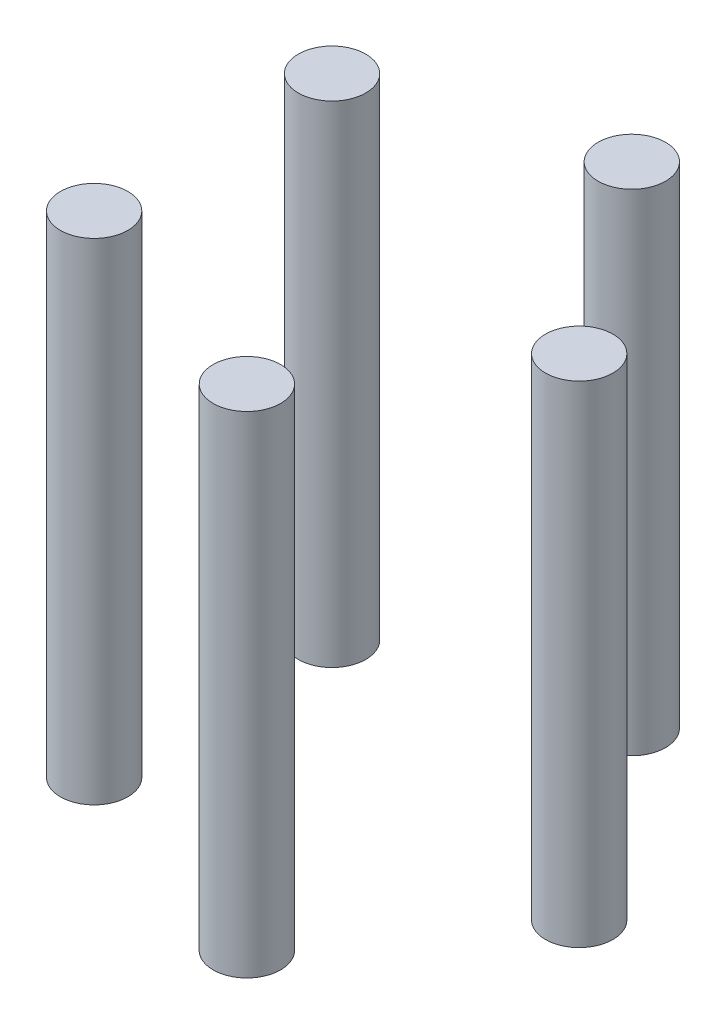
ISO-10303-21;
HEADER;
FILE_DESCRIPTION(('STEP AP214'),'2;1');
FILE_NAME('part.step','',(''),(''),'','','');
FILE_SCHEMA(('AUTOMOTIVE_DESIGN { 1 0 10303 214 1 1 1 1 }'));
ENDSEC;
DATA;
#1=APPLICATION_CONTEXT('core data for automotive mechanical design processes');
#2=APPLICATION_PROTOCOL_DEFINITION('international standard','automotive_design',2000,#1);
#3=PRODUCT_CONTEXT('',#1,'mechanical');
#4=PRODUCT('Part','Part','',(#3));
#5=PRODUCT_RELATED_PRODUCT_CATEGORY('part','',(#4));
#6=PRODUCT_DEFINITION_FORMATION('','',#4);
#7=PRODUCT_DEFINITION_CONTEXT('part definition',#1,'design');
#8=PRODUCT_DEFINITION('design','',#6,#7);
#9=PRODUCT_DEFINITION_SHAPE('','',#8);
#10=(LENGTH_UNIT() NAMED_UNIT(*) SI_UNIT(.MILLI.,.METRE.));
#11=(NAMED_UNIT(*) PLANE_ANGLE_UNIT() SI_UNIT($,.RADIAN.));
#12=(NAMED_UNIT(*) SI_UNIT($,.STERADIAN.) SOLID_ANGLE_UNIT());
#13=UNCERTAINTY_MEASURE_WITH_UNIT(LENGTH_MEASURE(1.E-05),#10,'distance_accuracy_value','');
#14=(GEOMETRIC_REPRESENTATION_CONTEXT(3) GLOBAL_UNCERTAINTY_ASSIGNED_CONTEXT((#13)) GLOBAL_UNIT_ASSIGNED_CONTEXT((#10,
#11,#12)) REPRESENTATION_CONTEXT('',''));
#15=CARTESIAN_POINT('',(0.,0.,0.));
#16=DIRECTION('',(0.,0.,1.));
#17=DIRECTION('',(1.,0.,0.));
#18=AXIS2_PLACEMENT_3D('',#15,#16,#17);
#19=CARTESIAN_POINT('',(10.1975608143727,80.,31.3848650377402));
#20=DIRECTION('',(0.,-1.,0.));
#21=DIRECTION('',(0.,0.,-1.));
#22=AXIS2_PLACEMENT_3D('',#19,#20,#21);
#23=CYLINDRICAL_SURFACE('',#22,5.5);
#24=CARTESIAN_POINT('',(10.1975608143727,80.,31.3848650377402));
#25=DIRECTION('',(0.,1.,0.));
#26=DIRECTION('',(0.,0.,1.));
#27=AXIS2_PLACEMENT_3D('',#24,#25,#26);
#28=CIRCLE('',#27,5.5);
#29=CARTESIAN_POINT('',(10.1975608143727,80.,36.8848650377402));
#30=VERTEX_POINT('',#29);
#31=EDGE_CURVE('E11',#30,#30,#28,.T.);
#32=ORIENTED_EDGE('',*,*,#31,.F.);
#33=EDGE_LOOP('',(#32));
#34=FACE_BOUND('',#33,.T.);
#35=CARTESIAN_POINT('',(10.1975608143727,0.,31.3848650377402));
#36=DIRECTION('',(0.,1.,0.));
#37=DIRECTION('',(0.,0.,1.));
#38=AXIS2_PLACEMENT_3D('',#35,#36,#37);
#39=CIRCLE('',#38,5.5);
#40=CARTESIAN_POINT('',(10.1975608143727,0.,36.8848650377402));
#41=VERTEX_POINT('',#40);
#42=EDGE_CURVE('E49',#41,#41,#39,.T.);
#43=ORIENTED_EDGE('',*,*,#42,.T.);
#44=EDGE_LOOP('',(#43));
#45=FACE_BOUND('',#44,.T.);
#46=ADVANCED_FACE('F46',(#34,#45),#23,.T.);
#47=CARTESIAN_POINT('',(0.,80.,0.));
#48=DIRECTION('',(0.,1.,0.));
#49=DIRECTION('',(0.,0.,1.));
#50=AXIS2_PLACEMENT_3D('',#47,#48,#49);
#51=PLANE('',#50);
#52=ORIENTED_EDGE('',*,*,#31,.T.);
#53=EDGE_LOOP('',(#52));
#54=FACE_BOUND('',#53,.T.);
#55=ADVANCED_FACE('F61',(#54),#51,.T.);
#56=CARTESIAN_POINT('',(0.,0.,0.));
#57=DIRECTION('',(0.,1.,0.));
#58=DIRECTION('',(0.,0.,1.));
#59=AXIS2_PLACEMENT_3D('',#56,#57,#58);
#60=PLANE('',#59);
#61=ORIENTED_EDGE('',*,*,#42,.F.);
#62=EDGE_LOOP('',(#61));
#63=FACE_BOUND('',#62,.T.);
#64=ADVANCED_FACE('F59',(#63),#60,.F.);
#65=CLOSED_SHELL('',(#46,#55,#64));
#66=MANIFOLD_SOLID_BREP('B2',#65);
#67=CARTESIAN_POINT('',(33.,80.,0.));
#68=DIRECTION('',(0.,-1.,0.));
#69=DIRECTION('',(0.,0.,-1.));
#70=AXIS2_PLACEMENT_3D('',#67,#68,#69);
#71=CYLINDRICAL_SURFACE('',#70,5.5);
#72=CARTESIAN_POINT('',(33.,80.,0.));
#73=DIRECTION('',(0.,1.,0.));
#74=DIRECTION('',(0.,0.,1.));
#75=AXIS2_PLACEMENT_3D('',#72,#73,#74);
#76=CIRCLE('',#75,5.5);
#77=CARTESIAN_POINT('',(33.,80.,5.5));
#78=VERTEX_POINT('',#77);
#79=EDGE_CURVE('E45',#78,#78,#76,.T.);
#80=ORIENTED_EDGE('',*,*,#79,.F.);
#81=EDGE_LOOP('',(#80));
#82=FACE_BOUND('',#81,.T.);
#83=CARTESIAN_POINT('',(33.,0.,0.));
#84=DIRECTION('',(0.,1.,0.));
#85=DIRECTION('',(0.,0.,1.));
#86=AXIS2_PLACEMENT_3D('',#83,#84,#85);
#87=CIRCLE('',#86,5.5);
#88=CARTESIAN_POINT('',(33.,0.,5.5));
#89=VERTEX_POINT('',#88);
#90=EDGE_CURVE('E110',#89,#89,#87,.T.);
#91=ORIENTED_EDGE('',*,*,#90,.T.);
#92=EDGE_LOOP('',(#91));
#93=FACE_BOUND('',#92,.T.);
#94=ADVANCED_FACE('F107',(#82,#93),#71,.T.);
#95=CARTESIAN_POINT('',(0.,80.,0.));
#96=DIRECTION('',(0.,1.,0.));
#97=DIRECTION('',(0.,0.,1.));
#98=AXIS2_PLACEMENT_3D('',#95,#96,#97);
#99=PLANE('',#98);
#100=ORIENTED_EDGE('',*,*,#79,.T.);
#101=EDGE_LOOP('',(#100));
#102=FACE_BOUND('',#101,.T.);
#103=ADVANCED_FACE('F122',(#102),#99,.T.);
#104=CARTESIAN_POINT('',(0.,0.,0.));
#105=DIRECTION('',(0.,1.,0.));
#106=DIRECTION('',(0.,0.,1.));
#107=AXIS2_PLACEMENT_3D('',#104,#105,#106);
#108=PLANE('',#107);
#109=ORIENTED_EDGE('',*,*,#90,.F.);
#110=EDGE_LOOP('',(#109));
#111=FACE_BOUND('',#110,.T.);
#112=ADVANCED_FACE('F120',(#111),#108,.F.);
#113=CLOSED_SHELL('',(#94,#103,#112));
#114=MANIFOLD_SOLID_BREP('B6',#113);
#115=CARTESIAN_POINT('',(10.1975608143733,80.,-31.3848650377401));
#116=DIRECTION('',(0.,-1.,0.));
#117=DIRECTION('',(0.,0.,-1.));
#118=AXIS2_PLACEMENT_3D('',#115,#116,#117);
#119=CYLINDRICAL_SURFACE('',#118,5.49999999999917);
#120=CARTESIAN_POINT('',(10.1975608143733,80.,-31.3848650377401));
#121=DIRECTION('',(0.,1.,0.));
#122=DIRECTION('',(0.,0.,1.));
#123=AXIS2_PLACEMENT_3D('',#120,#121,#122);
#124=CIRCLE('',#123,5.49999999999917);
#125=CARTESIAN_POINT('',(10.1975608143733,80.,-25.8848650377409));
#126=VERTEX_POINT('',#125);
#127=EDGE_CURVE('E106',#126,#126,#124,.T.);
#128=ORIENTED_EDGE('',*,*,#127,.F.);
#129=EDGE_LOOP('',(#128));
#130=FACE_BOUND('',#129,.T.);
#131=CARTESIAN_POINT('',(10.1975608143733,0.,-31.3848650377401));
#132=DIRECTION('',(0.,1.,0.));
#133=DIRECTION('',(0.,0.,1.));
#134=AXIS2_PLACEMENT_3D('',#131,#132,#133);
#135=CIRCLE('',#134,5.49999999999917);
#136=CARTESIAN_POINT('',(10.1975608143733,0.,-25.8848650377409));
#137=VERTEX_POINT('',#136);
#138=EDGE_CURVE('E171',#137,#137,#135,.T.);
#139=ORIENTED_EDGE('',*,*,#138,.T.);
#140=EDGE_LOOP('',(#139));
#141=FACE_BOUND('',#140,.T.);
#142=ADVANCED_FACE('F168',(#130,#141),#119,.T.);
#143=CARTESIAN_POINT('',(0.,80.,0.));
#144=DIRECTION('',(0.,1.,0.));
#145=DIRECTION('',(0.,0.,1.));
#146=AXIS2_PLACEMENT_3D('',#143,#144,#145);
#147=PLANE('',#146);
#148=ORIENTED_EDGE('',*,*,#127,.T.);
#149=EDGE_LOOP('',(#148));
#150=FACE_BOUND('',#149,.T.);
#151=ADVANCED_FACE('F183',(#150),#147,.T.);
#152=CARTESIAN_POINT('',(0.,0.,0.));
#153=DIRECTION('',(0.,1.,0.));
#154=DIRECTION('',(0.,0.,1.));
#155=AXIS2_PLACEMENT_3D('',#152,#153,#154);
#156=PLANE('',#155);
#157=ORIENTED_EDGE('',*,*,#138,.F.);
#158=EDGE_LOOP('',(#157));
#159=FACE_BOUND('',#158,.T.);
#160=ADVANCED_FACE('F181',(#159),#156,.F.);
#161=CLOSED_SHELL('',(#142,#151,#160));
#162=MANIFOLD_SOLID_BREP('B40',#161);
#163=CARTESIAN_POINT('',(-26.6975608143728,80.,-19.3969133256522));
#164=DIRECTION('',(0.,-1.,0.));
#165=DIRECTION('',(0.,0.,-1.));
#166=AXIS2_PLACEMENT_3D('',#163,#164,#165);
#167=CYLINDRICAL_SURFACE('',#166,5.50000000000001);
#168=CARTESIAN_POINT('',(-26.6975608143728,80.,-19.3969133256522));
#169=DIRECTION('',(0.,1.,0.));
#170=DIRECTION('',(0.,0.,1.));
#171=AXIS2_PLACEMENT_3D('',#168,#169,#170);
#172=CIRCLE('',#171,5.50000000000001);
#173=CARTESIAN_POINT('',(-26.6975608143728,80.,-13.8969133256522));
#174=VERTEX_POINT('',#173);
#175=EDGE_CURVE('E167',#174,#174,#172,.T.);
#176=ORIENTED_EDGE('',*,*,#175,.F.);
#177=EDGE_LOOP('',(#176));
#178=FACE_BOUND('',#177,.T.);
#179=CARTESIAN_POINT('',(-26.6975608143728,0.,-19.3969133256522));
#180=DIRECTION('',(0.,1.,0.));
#181=DIRECTION('',(0.,0.,1.));
#182=AXIS2_PLACEMENT_3D('',#179,#180,#181);
#183=CIRCLE('',#182,5.50000000000001);
#184=CARTESIAN_POINT('',(-26.6975608143728,0.,-13.8969133256522));
#185=VERTEX_POINT('',#184);
#186=EDGE_CURVE('E231',#185,#185,#183,.T.);
#187=ORIENTED_EDGE('',*,*,#186,.T.);
#188=EDGE_LOOP('',(#187));
#189=FACE_BOUND('',#188,.T.);
#190=ADVANCED_FACE('F228',(#178,#189),#167,.T.);
#191=CARTESIAN_POINT('',(0.,80.,0.));
#192=DIRECTION('',(0.,1.,0.));
#193=DIRECTION('',(0.,0.,1.));
#194=AXIS2_PLACEMENT_3D('',#191,#192,#193);
#195=PLANE('',#194);
#196=ORIENTED_EDGE('',*,*,#175,.T.);
#197=EDGE_LOOP('',(#196));
#198=FACE_BOUND('',#197,.T.);
#199=ADVANCED_FACE('F243',(#198),#195,.T.);
#200=CARTESIAN_POINT('',(0.,0.,0.));
#201=DIRECTION('',(0.,1.,0.));
#202=DIRECTION('',(0.,0.,1.));
#203=AXIS2_PLACEMENT_3D('',#200,#201,#202);
#204=PLANE('',#203);
#205=ORIENTED_EDGE('',*,*,#186,.F.);
#206=EDGE_LOOP('',(#205));
#207=FACE_BOUND('',#206,.T.);
#208=ADVANCED_FACE('F241',(#207),#204,.F.);
#209=CLOSED_SHELL('',(#190,#199,#208));
#210=MANIFOLD_SOLID_BREP('B101',#209);
#211=CARTESIAN_POINT('',(-26.6975608143736,80.,19.3969133256511));
#212=DIRECTION('',(0.,-1.,0.));
#213=DIRECTION('',(0.,0.,-1.));
#214=AXIS2_PLACEMENT_3D('',#211,#212,#213);
#215=CYLINDRICAL_SURFACE('',#214,5.5);
#216=CARTESIAN_POINT('',(-26.6975608143736,80.,19.3969133256511));
#217=DIRECTION('',(0.,1.,0.));
#218=DIRECTION('',(0.,0.,1.));
#219=AXIS2_PLACEMENT_3D('',#216,#217,#218);
#220=CIRCLE('',#219,5.5);
#221=CARTESIAN_POINT('',(-26.6975608143736,80.,24.8969133256511));
#222=VERTEX_POINT('',#221);
#223=EDGE_CURVE('E227',#222,#222,#220,.T.);
#224=ORIENTED_EDGE('',*,*,#223,.F.);
#225=EDGE_LOOP('',(#224));
#226=FACE_BOUND('',#225,.T.);
#227=CARTESIAN_POINT('',(-26.6975608143736,0.,19.3969133256511));
#228=DIRECTION('',(0.,1.,0.));
#229=DIRECTION('',(0.,0.,1.));
#230=AXIS2_PLACEMENT_3D('',#227,#228,#229);
#231=CIRCLE('',#230,5.5);
#232=CARTESIAN_POINT('',(-26.6975608143736,0.,24.8969133256511));
#233=VERTEX_POINT('',#232);
#234=EDGE_CURVE('E284',#233,#233,#231,.T.);
#235=ORIENTED_EDGE('',*,*,#234,.T.);
#236=EDGE_LOOP('',(#235));
#237=FACE_BOUND('',#236,.T.);
#238=ADVANCED_FACE('F281',(#226,#237),#215,.T.);
#239=CARTESIAN_POINT('',(0.,80.,0.));
#240=DIRECTION('',(0.,1.,0.));
#241=DIRECTION('',(0.,0.,1.));
#242=AXIS2_PLACEMENT_3D('',#239,#240,#241);
#243=PLANE('',#242);
#244=ORIENTED_EDGE('',*,*,#223,.T.);
#245=EDGE_LOOP('',(#244));
#246=FACE_BOUND('',#245,.T.);
#247=ADVANCED_FACE('F296',(#246),#243,.T.);
#248=CARTESIAN_POINT('',(0.,0.,0.));
#249=DIRECTION('',(0.,1.,0.));
#250=DIRECTION('',(0.,0.,1.));
#251=AXIS2_PLACEMENT_3D('',#248,#249,#250);
#252=PLANE('',#251);
#253=ORIENTED_EDGE('',*,*,#234,.F.);
#254=EDGE_LOOP('',(#253));
#255=FACE_BOUND('',#254,.T.);
#256=ADVANCED_FACE('F294',(#255),#252,.F.);
#257=CLOSED_SHELL('',(#238,#247,#256));
#258=MANIFOLD_SOLID_BREP('B162',#257);
#259=ADVANCED_BREP_SHAPE_REPRESENTATION('',(#18,#66,#114,#162,#210,#258),#14);
#260=SHAPE_DEFINITION_REPRESENTATION(#9,#259);
ENDSEC;
END-ISO-10303-21;
